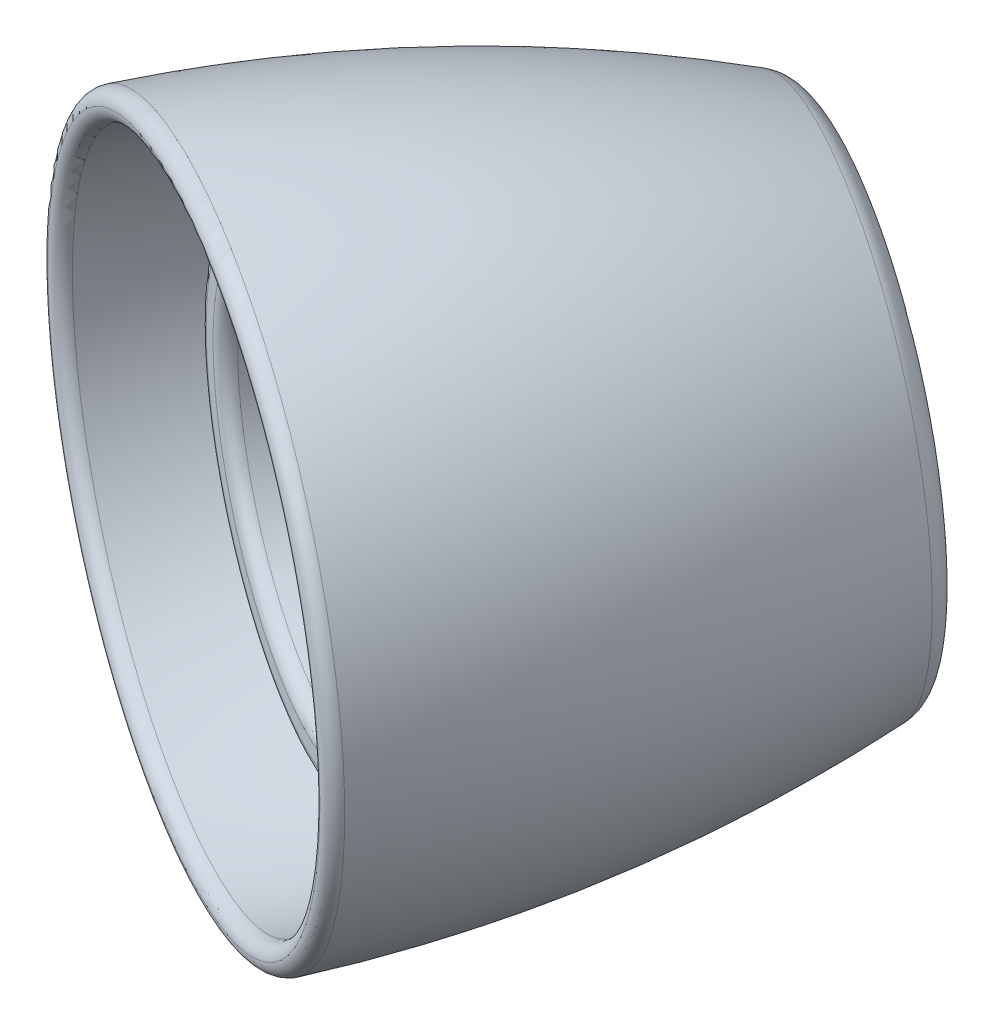
ISO-10303-21;
HEADER;
FILE_DESCRIPTION(('STEP AP214'),'2;1');
FILE_NAME('part.step','',(''),(''),'','','');
FILE_SCHEMA(('AUTOMOTIVE_DESIGN { 1 0 10303 214 1 1 1 1 }'));
ENDSEC;
DATA;
#1=APPLICATION_CONTEXT('core data for automotive mechanical design processes');
#2=APPLICATION_PROTOCOL_DEFINITION('international standard','automotive_design',2000,#1);
#3=PRODUCT_CONTEXT('',#1,'mechanical');
#4=PRODUCT('Part','Part','',(#3));
#5=PRODUCT_RELATED_PRODUCT_CATEGORY('part','',(#4));
#6=PRODUCT_DEFINITION_FORMATION('','',#4);
#7=PRODUCT_DEFINITION_CONTEXT('part definition',#1,'design');
#8=PRODUCT_DEFINITION('design','',#6,#7);
#9=PRODUCT_DEFINITION_SHAPE('','',#8);
#10=(LENGTH_UNIT() NAMED_UNIT(*) SI_UNIT(.MILLI.,.METRE.));
#11=(NAMED_UNIT(*) PLANE_ANGLE_UNIT() SI_UNIT($,.RADIAN.));
#12=(NAMED_UNIT(*) SI_UNIT($,.STERADIAN.) SOLID_ANGLE_UNIT());
#13=UNCERTAINTY_MEASURE_WITH_UNIT(LENGTH_MEASURE(1.E-05),#10,'distance_accuracy_value','');
#14=(GEOMETRIC_REPRESENTATION_CONTEXT(3) GLOBAL_UNCERTAINTY_ASSIGNED_CONTEXT((#13)) GLOBAL_UNIT_ASSIGNED_CONTEXT((#10,
#11,#12)) REPRESENTATION_CONTEXT('',''));
#15=CARTESIAN_POINT('',(0.,0.,0.));
#16=DIRECTION('',(0.,0.,1.));
#17=DIRECTION('',(1.,0.,0.));
#18=AXIS2_PLACEMENT_3D('',#15,#16,#17);
#19=CARTESIAN_POINT('',(-1.92824216806043,-8.23663197239245,23.7918539048536));
#20=DIRECTION('',(-0.453212083113773,-0.0300186712748521,0.890897124866035));
#21=DIRECTION('',(0.41626094218873,-0.890897124866035,0.181739211271491));
#22=AXIS2_PLACEMENT_3D('',#19,#20,#21);
#23=CYLINDRICAL_SURFACE('',#22,3.24582561371548);
#24=CARTESIAN_POINT('',(2.34781383611801,-7.95340580891422,15.3862395317425));
#25=DIRECTION('',(0.453212083113773,0.0300186712748521,-0.890897124866035));
#26=DIRECTION('',(0.41626094218873,-0.890897124866035,0.181739211271491));
#27=AXIS2_PLACEMENT_3D('',#24,#25,#26);
#28=CIRCLE('',#27,3.24582561371548);
#29=CARTESIAN_POINT('',(3.69892426426354,-10.8451025159899,15.976133318704));
#30=VERTEX_POINT('',#29);
#31=EDGE_CURVE('E93',#30,#30,#28,.F.);
#32=ORIENTED_EDGE('',*,*,#31,.F.);
#33=EDGE_LOOP('',(#32));
#34=FACE_BOUND('',#33,.T.);
#35=CARTESIAN_POINT('',(1.84928054469287,-7.98642634731656,16.3662263690952));
#36=DIRECTION('',(-0.453212083113773,-0.0300186712748521,0.890897124866035));
#37=DIRECTION('',(-0.41626094218873,0.890897124866035,-0.181739211271491));
#38=AXIS2_PLACEMENT_3D('',#35,#36,#37);
#39=CIRCLE('',#38,3.24582561371548);
#40=CARTESIAN_POINT('',(0.498170116547345,-5.09472964024091,15.7763325821337));
#41=VERTEX_POINT('',#40);
#42=EDGE_CURVE('E97',#41,#41,#39,.F.);
#43=ORIENTED_EDGE('',*,*,#42,.F.);
#44=EDGE_LOOP('',(#43));
#45=FACE_BOUND('',#44,.T.);
#46=ADVANCED_FACE('F15',(#34,#45),#23,.F.);
#47=CARTESIAN_POINT('',(0.609668121717728,-5.58336181099489,16.0972048205766));
#48=DIRECTION('',(0.453212083113773,0.0300186712748521,-0.890897124866035));
#49=DIRECTION('',(-0.41626094218873,0.890897124866035,-0.181739211271491));
#50=AXIS2_PLACEMENT_3D('',#47,#48,#49);
#51=PLANE('',#50);
#52=CARTESIAN_POINT('',(1.73597752391442,-7.99393101513527,16.5889506503116));
#53=DIRECTION('',(-0.453212083113773,-0.0300186712748521,0.890897124866035));
#54=DIRECTION('',(-0.41626094218873,0.890897124866035,-0.181739211271491));
#55=AXIS2_PLACEMENT_3D('',#52,#53,#54);
#56=CIRCLE('',#55,2.99582561371548);
#57=CARTESIAN_POINT('',(0.488932331316082,-5.32495858927612,16.0444916661681));
#58=VERTEX_POINT('',#57);
#59=EDGE_CURVE('E85',#58,#58,#56,.T.);
#60=ORIENTED_EDGE('',*,*,#59,.F.);
#61=EDGE_LOOP('',(#60));
#62=FACE_BOUND('',#61,.T.);
#63=CARTESIAN_POINT('',(1.73597752391442,-7.99393101513527,16.5889506503116));
#64=DIRECTION('',(-0.453212083113773,-0.0300186712748521,0.890897124866035));
#65=DIRECTION('',(-0.41626094218873,0.890897124866035,-0.181739211271491));
#66=AXIS2_PLACEMENT_3D('',#63,#64,#65);
#67=CIRCLE('',#66,2.95577728545579);
#68=CARTESIAN_POINT('',(0.505602886170547,-5.36063752977838,16.0517700177587));
#69=VERTEX_POINT('',#68);
#70=EDGE_CURVE('E89',#69,#69,#67,.F.);
#71=ORIENTED_EDGE('',*,*,#70,.F.);
#72=EDGE_LOOP('',(#71));
#73=FACE_BOUND('',#72,.T.);
#74=ADVANCED_FACE('F181',(#62,#73),#51,.T.);
#75=CARTESIAN_POINT('',(-1.92824216806043,-8.23663197239245,23.7918539048536));
#76=DIRECTION('',(-0.453212083113773,-0.0300186712748521,0.890897124866035));
#77=DIRECTION('',(0.41626094218873,-0.890897124866035,0.181739211271491));
#78=AXIS2_PLACEMENT_3D('',#75,#76,#77);
#79=CYLINDRICAL_SURFACE('',#78,2.70577728545579);
#80=CARTESIAN_POINT('',(1.62267450313598,-8.00143568295398,16.8116749315281));
#81=DIRECTION('',(-0.453212083113773,-0.0300186712748521,0.890897124866035));
#82=DIRECTION('',(-0.41626094218873,0.890897124866035,-0.181739211271491));
#83=AXIS2_PLACEMENT_3D('',#80,#81,#82);
#84=CIRCLE('',#83,2.70577728545579);
#85=CARTESIAN_POINT('',(0.496365100939284,-5.5908664788136,16.3199291017931));
#86=VERTEX_POINT('',#85);
#87=EDGE_CURVE('E78',#86,#86,#84,.T.);
#88=ORIENTED_EDGE('',*,*,#87,.F.);
#89=EDGE_LOOP('',(#88));
#90=FACE_BOUND('',#89,.T.);
#91=CARTESIAN_POINT('',(1.21478362833358,-8.02845248710135,17.6134823439076));
#92=DIRECTION('',(0.453212083113773,0.0300186712748521,-0.890897124866035));
#93=DIRECTION('',(0.41626094218873,-0.890897124866035,0.181739211271491));
#94=AXIS2_PLACEMENT_3D('',#91,#92,#93);
#95=CIRCLE('',#94,2.70577728545579);
#96=CARTESIAN_POINT('',(2.34109303053027,-10.4390216912417,18.1052281736427));
#97=VERTEX_POINT('',#96);
#98=EDGE_CURVE('E81',#97,#97,#95,.T.);
#99=ORIENTED_EDGE('',*,*,#98,.F.);
#100=EDGE_LOOP('',(#99));
#101=FACE_BOUND('',#100,.T.);
#102=ADVANCED_FACE('F177',(#90,#101),#79,.F.);
#103=CARTESIAN_POINT('',(-0.0248287946415541,-5.62538795077968,17.3444607953891));
#104=DIRECTION('',(-0.453212083113773,-0.0300186712748521,0.890897124866035));
#105=DIRECTION('',(0.41626094218873,-0.890897124866035,0.181739211271491));
#106=AXIS2_PLACEMENT_3D('',#103,#104,#105);
#107=PLANE('',#106);
#108=CARTESIAN_POINT('',(1.10148060755513,-8.03595715492006,17.8362066251241));
#109=DIRECTION('',(0.453212083113773,0.0300186712748521,-0.890897124866035));
#110=DIRECTION('',(0.41626094218873,-0.890897124866035,0.181739211271491));
#111=AXIS2_PLACEMENT_3D('',#108,#109,#110);
#112=CIRCLE('',#111,2.95577728545579);
#113=CARTESIAN_POINT('',(2.33185524529901,-10.669250640277,18.373387257677));
#114=VERTEX_POINT('',#113);
#115=EDGE_CURVE('E70',#114,#114,#112,.F.);
#116=ORIENTED_EDGE('',*,*,#115,.F.);
#117=EDGE_LOOP('',(#116));
#118=FACE_BOUND('',#117,.T.);
#119=CARTESIAN_POINT('',(1.10148060755513,-8.03595715492006,17.8362066251241));
#120=DIRECTION('',(0.453212083113773,0.0300186712748521,-0.890897124866035));
#121=DIRECTION('',(0.41626094218873,-0.890897124866035,0.181739211271491));
#122=AXIS2_PLACEMENT_3D('',#119,#120,#121);
#123=CIRCLE('',#122,2.99582561371548);
#124=CARTESIAN_POINT('',(2.34852580015347,-10.7049295807792,18.3806656092677));
#125=VERTEX_POINT('',#124);
#126=EDGE_CURVE('E74',#125,#125,#123,.T.);
#127=ORIENTED_EDGE('',*,*,#126,.F.);
#128=EDGE_LOOP('',(#127));
#129=FACE_BOUND('',#128,.T.);
#130=ADVANCED_FACE('F173',(#118,#129),#107,.T.);
#131=CARTESIAN_POINT('',(-1.92824216806043,-8.23663197239245,23.7918539048536));
#132=DIRECTION('',(-0.453212083113773,-0.0300186712748521,0.890897124866035));
#133=DIRECTION('',(0.41626094218873,-0.890897124866035,0.181739211271491));
#134=AXIS2_PLACEMENT_3D('',#131,#132,#133);
#135=CYLINDRICAL_SURFACE('',#134,3.24582561371548);
#136=CARTESIAN_POINT('',(0.988177586776692,-8.04346182273878,18.0589309063406));
#137=DIRECTION('',(0.453212083113773,0.0300186712748521,-0.890897124866035));
#138=DIRECTION('',(0.41626094218873,-0.890897124866035,0.181739211271491));
#139=AXIS2_PLACEMENT_3D('',#136,#137,#138);
#140=CIRCLE('',#139,3.24582561371548);
#141=CARTESIAN_POINT('',(2.33928801492221,-10.9351585298144,18.6488246933021));
#142=VERTEX_POINT('',#141);
#143=EDGE_CURVE('E62',#142,#142,#140,.F.);
#144=ORIENTED_EDGE('',*,*,#143,.F.);
#145=EDGE_LOOP('',(#144));
#146=FACE_BOUND('',#145,.T.);
#147=CARTESIAN_POINT('',(0.528727867670788,-8.07389364615885,18.9620896018452));
#148=DIRECTION('',(0.453212083113773,0.0300186712748521,-0.890897124866035));
#149=DIRECTION('',(0.41626094218873,-0.890897124866035,0.181739211271491));
#150=AXIS2_PLACEMENT_3D('',#147,#148,#149);
#151=CIRCLE('',#150,3.24582561371548);
#152=CARTESIAN_POINT('',(1.87983829581631,-10.9655903532345,19.5519833888067));
#153=VERTEX_POINT('',#152);
#154=EDGE_CURVE('E66',#153,#153,#151,.T.);
#155=ORIENTED_EDGE('',*,*,#154,.F.);
#156=EDGE_LOOP('',(#155));
#157=FACE_BOUND('',#156,.T.);
#158=ADVANCED_FACE('F169',(#146,#157),#135,.F.);
#159=CARTESIAN_POINT('',(-0.935685581253175,-5.18970160690191,18.5949200961003));
#160=DIRECTION('',(-0.453212083113773,-0.0300186712748521,0.890897124866035));
#161=DIRECTION('',(0.41626094218873,-0.890897124866035,0.181739211271491));
#162=AXIS2_PLACEMENT_3D('',#159,#160,#161);
#163=PLANE('',#162);
#164=CARTESIAN_POINT('',(0.415424846892344,-8.08139831397756,19.1848138830617));
#165=DIRECTION('',(0.453212083113773,0.0300186712748521,-0.890897124866035));
#166=DIRECTION('',(0.41626094218873,-0.890897124866035,0.181739211271491));
#167=AXIS2_PLACEMENT_3D('',#164,#165,#166);
#168=CIRCLE('',#167,3.49582561371548);
#169=CARTESIAN_POINT('',(1.87060051058505,-11.1958193022697,19.8201424728411));
#170=VERTEX_POINT('',#169);
#171=EDGE_CURVE('E38',#170,#170,#168,.F.);
#172=ORIENTED_EDGE('',*,*,#171,.F.);
#173=EDGE_LOOP('',(#172));
#174=FACE_BOUND('',#173,.T.);
#175=CARTESIAN_POINT('',(0.415424846892344,-8.08139831397756,19.1848138830617));
#176=DIRECTION('',(0.453212083113773,0.0300186712748521,-0.890897124866035));
#177=DIRECTION('',(0.41626094218873,-0.890897124866035,0.181739211271491));
#178=AXIS2_PLACEMENT_3D('',#175,#176,#177);
#179=CIRCLE('',#178,3.77857088456341);
#180=CARTESIAN_POINT('',(1.98829632342761,-11.4477162511376,19.8715283753557));
#181=VERTEX_POINT('',#180);
#182=EDGE_CURVE('E44',#181,#181,#179,.T.);
#183=ORIENTED_EDGE('',*,*,#182,.F.);
#184=EDGE_LOOP('',(#183));
#185=FACE_BOUND('',#184,.T.);
#186=ADVANCED_FACE('F165',(#174,#185),#163,.T.);
#187=CARTESIAN_POINT('',(-1.92824216806043,-8.23663197239245,23.7918539048536));
#188=DIRECTION('',(-0.453212083113773,-0.0300186712748521,0.890897124866035));
#189=DIRECTION('',(0.41626094218873,-0.890897124866035,0.181739211271491));
#190=AXIS2_PLACEMENT_3D('',#187,#188,#189);
#191=CYLINDRICAL_SURFACE('',#190,4.02857088456341);
#192=CARTESIAN_POINT('',(1.47541420474449,-8.01118952371409,17.1011503919848));
#193=DIRECTION('',(0.453212083113773,0.0300186712748521,-0.890897124866035));
#194=DIRECTION('',(0.41626094218873,-0.890897124866035,0.181739211271491));
#195=AXIS2_PLACEMENT_3D('',#192,#193,#194);
#196=CIRCLE('',#195,4.02857088456341);
#197=CARTESIAN_POINT('',(3.15235091682695,-11.6002317420906,17.8332996870967));
#198=VERTEX_POINT('',#197);
#199=EDGE_CURVE('E55',#198,#198,#196,.T.);
#200=ORIENTED_EDGE('',*,*,#199,.F.);
#201=EDGE_LOOP('',(#200));
#202=FACE_BOUND('',#201,.T.);
#203=CARTESIAN_POINT('',(0.528727867670788,-8.07389364615885,18.9620896018452));
#204=DIRECTION('',(0.453212083113773,0.0300186712748521,-0.890897124866035));
#205=DIRECTION('',(0.41626094218873,-0.890897124866035,0.181739211271491));
#206=AXIS2_PLACEMENT_3D('',#203,#204,#205);
#207=CIRCLE('',#206,4.02857088456341);
#208=CARTESIAN_POINT('',(2.20566457975324,-11.6629358645354,19.694238896957));
#209=VERTEX_POINT('',#208);
#210=EDGE_CURVE('E58',#209,#209,#207,.F.);
#211=ORIENTED_EDGE('',*,*,#210,.F.);
#212=EDGE_LOOP('',(#211));
#213=FACE_BOUND('',#212,.T.);
#214=ADVANCED_FACE('F161',(#202,#213),#191,.T.);
#215=CARTESIAN_POINT('',(-0.0882194865595111,-4.41464263751883,16.1462768156565));
#216=DIRECTION('',(-0.453212083113773,-0.0300186712748521,0.890897124866035));
#217=DIRECTION('',(0.41626094218873,-0.890897124866035,0.181739211271491));
#218=AXIS2_PLACEMENT_3D('',#215,#216,#217);
#219=PLANE('',#218);
#220=CARTESIAN_POINT('',(1.58871722552294,-8.00368485589538,16.8784261107683));
#221=DIRECTION('',(0.453212083113773,0.0300186712748521,-0.890897124866035));
#222=DIRECTION('',(0.41626094218873,-0.890897124866035,0.181739211271491));
#223=AXIS2_PLACEMENT_3D('',#220,#221,#222);
#224=CIRCLE('',#223,4.2785708845634);
#225=CARTESIAN_POINT('',(3.36971917315257,-11.8154513554884,17.656010208698));
#226=VERTEX_POINT('',#225);
#227=EDGE_CURVE('E48',#226,#226,#224,.F.);
#228=ORIENTED_EDGE('',*,*,#227,.F.);
#229=EDGE_LOOP('',(#228));
#230=FACE_BOUND('',#229,.T.);
#231=CARTESIAN_POINT('',(1.58871722552294,-8.00368485589538,16.8784261107683));
#232=DIRECTION('',(0.453212083113773,0.0300186712748521,-0.890897124866035));
#233=DIRECTION('',(0.41626094218873,-0.890897124866035,0.181739211271491));
#234=AXIS2_PLACEMENT_3D('',#231,#232,#233);
#235=CIRCLE('',#234,4.79273774166151);
#236=CARTESIAN_POINT('',(3.58374675353045,-12.2735211301786,17.749454487769));
#237=VERTEX_POINT('',#236);
#238=EDGE_CURVE('E52',#237,#237,#235,.T.);
#239=ORIENTED_EDGE('',*,*,#238,.F.);
#240=EDGE_LOOP('',(#239));
#241=FACE_BOUND('',#240,.T.);
#242=ADVANCED_FACE('F157',(#230,#241),#219,.T.);
#243=CARTESIAN_POINT('',(2.17155907076244,-4.55561842241409,12.0205937841694));
#244=CARTESIAN_POINT('',(1.73924212667713,-4.33531117061553,12.5993762028067));
#245=CARTESIAN_POINT('',(0.886072689311537,-3.95010381774629,13.7955572675327));
#246=CARTESIAN_POINT('',(-0.315878130017248,-3.5609253915247,15.647875886709));
#247=CARTESIAN_POINT('',(-1.45022401878436,-3.35375627529409,17.5703422472452));
#248=CARTESIAN_POINT('',(-2.16576616894374,-3.33850083961202,18.9087010873886));
#249=CARTESIAN_POINT('',(-2.50783947202255,-3.36115630113467,19.5811262065507));
#250=B_SPLINE_CURVE_WITH_KNOTS('',3,(#243,#244,#245,#246,#247,#248,#249),.UNSPECIFIED.,.F.,.F.,
(4,1,1,1,4),(0.,0.25,0.5,0.75,1.),.UNSPECIFIED.);
#251=CARTESIAN_POINT('',(-1.92824216806043,-8.23663197239245,23.7918539048536));
#252=DIRECTION('',(-0.453212083113773,-0.0300186712748521,0.890897124866035));
#253=AXIS1_PLACEMENT('',#251,#252);
#254=SURFACE_OF_REVOLUTION('',#250,#253);
#255=CARTESIAN_POINT('',(1.49343277529732,-8.00999605697651,17.0657305669232));
#256=DIRECTION('',(0.453212083113773,0.0300186712748521,-0.890897124866035));
#257=DIRECTION('',(0.41626094218873,-0.890897124866035,0.181739211271491));
#258=AXIS2_PLACEMENT_3D('',#255,#256,#257);
#259=CIRCLE('',#258,5.03955618251426);
#260=CARTESIAN_POINT('',(3.59120318004374,-12.4997221705793,17.9816155326917));
#261=VERTEX_POINT('',#260);
#262=EDGE_CURVE('E31',#261,#261,#259,.F.);
#263=ORIENTED_EDGE('',*,*,#262,.F.);
#264=EDGE_LOOP('',(#263));
#265=FACE_BOUND('',#264,.T.);
#266=CARTESIAN_POINT('',(-0.168631587893767,-8.120083509662,20.3329169851139));
#267=DIRECTION('',(0.453212083113773,0.0300186712748521,-0.890897124866035));
#268=DIRECTION('',(0.41626094218873,-0.890897124866035,0.181739211271491));
#269=AXIS2_PLACEMENT_3D('',#266,#267,#268);
#270=CIRCLE('',#269,5.34884288988972);
#271=CARTESIAN_POINT('',(2.05788279307122,-12.8853522616249,21.3050114731376));
#272=VERTEX_POINT('',#271);
#273=EDGE_CURVE('E101',#272,#272,#270,.T.);
#274=ORIENTED_EDGE('',*,*,#273,.F.);
#275=EDGE_LOOP('',(#274));
#276=FACE_BOUND('',#275,.T.);
#277=ADVANCED_FACE('F153',(#265,#276),#254,.F.);
#278=CARTESIAN_POINT('',(-2.50783947202256,-3.36115630113466,19.5811262065507));
#279=DIRECTION('',(-0.453212083113773,-0.0300186712748521,0.890897124866035));
#280=DIRECTION('',(0.41626094218873,-0.890897124866035,0.181739211271491));
#281=AXIS2_PLACEMENT_3D('',#278,#279,#280);
#282=PLANE('',#281);
#283=CARTESIAN_POINT('',(-0.28081624594187,-8.12751410230836,20.5534428559655));
#284=DIRECTION('',(0.453212083113773,0.0300186712748521,-0.890897124866035));
#285=DIRECTION('',(0.41626094218873,-0.890897124866035,0.181739211271491));
#286=AXIS2_PLACEMENT_3D('',#283,#284,#285);
#287=CIRCLE('',#286,5.59884535934687);
#288=CARTESIAN_POINT('',(2.04976439850886,-13.11550933552,21.5709725956042));
#289=VERTEX_POINT('',#288);
#290=EDGE_CURVE('E108',#289,#289,#287,.T.);
#291=ORIENTED_EDGE('',*,*,#290,.F.);
#292=EDGE_LOOP('',(#291));
#293=FACE_BOUND('',#292,.T.);
#294=CARTESIAN_POINT('',(-0.28081624594187,-8.12751410230836,20.5534428559655));
#295=DIRECTION('',(0.453212083113773,0.0300186712748521,-0.890897124866035));
#296=DIRECTION('',(0.41626094218873,-0.890897124866035,0.181739211271491));
#297=AXIS2_PLACEMENT_3D('',#294,#295,#296);
#298=CIRCLE('',#297,5.59883071113216);
#299=CARTESIAN_POINT('',(2.0497583010292,-13.1154962854677,21.5709699334493));
#300=VERTEX_POINT('',#299);
#301=EDGE_CURVE('E112',#300,#300,#298,.F.);
#302=ORIENTED_EDGE('',*,*,#301,.F.);
#303=EDGE_LOOP('',(#302));
#304=FACE_BOUND('',#303,.T.);
#305=ADVANCED_FACE('F148',(#293,#304),#282,.T.);
#306=CARTESIAN_POINT('',(-2.71596994311693,-2.91570773870165,19.4902566009149));
#307=CARTESIAN_POINT('',(-0.607069006577418,-2.7760238990073,15.3447056524892));
#308=CARTESIAN_POINT('',(2.05860671361164,-4.13443398663146,11.7759105578051));
#309=B_SPLINE_CURVE_WITH_KNOTS('',2,(#306,#307,#308),.UNSPECIFIED.,.F.,.F.,(3,3),(0.,1.),.UNSPECIFIED.);
#310=CARTESIAN_POINT('',(-1.92824216806043,-8.23663197239245,23.7918539048536));
#311=DIRECTION('',(-0.453212083113773,-0.0300186712748521,0.890897124866035));
#312=AXIS1_PLACEMENT('',#310,#311);
#313=SURFACE_OF_REVOLUTION('',#309,#312);
#314=CARTESIAN_POINT('',(-0.166406486762289,-8.11993612925907,20.3285430147931));
#315=DIRECTION('',(0.453212083113773,0.0300186712748521,-0.890897124866035));
#316=DIRECTION('',(0.41626094218873,-0.890897124866035,0.181739211271491));
#317=AXIS2_PLACEMENT_3D('',#314,#315,#316);
#318=CIRCLE('',#317,5.84883343245303);
#319=CARTESIAN_POINT('',(2.26823442853556,-13.3306450180518,21.3915053896654));
#320=VERTEX_POINT('',#319);
#321=EDGE_CURVE('E105',#320,#320,#318,.F.);
#322=ORIENTED_EDGE('',*,*,#321,.F.);
#323=EDGE_LOOP('',(#322));
#324=FACE_BOUND('',#323,.T.);
#325=CARTESIAN_POINT('',(3.64994534361208,-7.86715864310271,12.8265875289676));
#326=DIRECTION('',(0.453212083113773,0.0300186712748521,-0.890897124866035));
#327=DIRECTION('',(0.41626094218873,-0.890897124866035,0.181739211271491));
#328=AXIS2_PLACEMENT_3D('',#325,#326,#327);
#329=CIRCLE('',#328,4.30199098337212);
#330=CARTESIAN_POINT('',(5.44069616363798,-11.6997900413885,13.6084279771828));
#331=VERTEX_POINT('',#330);
#332=EDGE_CURVE('E128',#331,#331,#329,.T.);
#333=ORIENTED_EDGE('',*,*,#332,.F.);
#334=EDGE_LOOP('',(#333));
#335=FACE_BOUND('',#334,.T.);
#336=ADVANCED_FACE('F143',(#324,#335),#313,.F.);
#337=CARTESIAN_POINT('',(2.65337491106307,-5.4073789674531,12.0355859011746));
#338=DIRECTION('',(0.453212083113773,0.0300186712748521,-0.890897124866035));
#339=DIRECTION('',(-0.41626094218873,0.890897124866035,-0.181739211271491));
#340=AXIS2_PLACEMENT_3D('',#337,#338,#339);
#341=PLANE('',#340);
#342=CARTESIAN_POINT('',(3.79809250208208,-7.85734606083469,12.5353687321712));
#343=DIRECTION('',(-0.453212083113773,-0.0300186712748521,0.890897124866035));
#344=DIRECTION('',(-0.41626094218873,0.890897124866035,-0.181739211271491));
#345=AXIS2_PLACEMENT_3D('',#342,#343,#344);
#346=CIRCLE('',#345,3.83291702671831);
#347=CARTESIAN_POINT('',(2.20259884920909,-4.44261130188127,11.8387774148663));
#348=VERTEX_POINT('',#347);
#349=EDGE_CURVE('E120',#348,#348,#346,.T.);
#350=ORIENTED_EDGE('',*,*,#349,.F.);
#351=EDGE_LOOP('',(#350));
#352=FACE_BOUND('',#351,.T.);
#353=CARTESIAN_POINT('',(3.79809250208208,-7.85734606083469,12.5353687321712));
#354=DIRECTION('',(-0.453212083113773,-0.0300186712748521,0.890897124866035));
#355=DIRECTION('',(-0.41626094218873,0.890897124866035,-0.181739211271491));
#356=AXIS2_PLACEMENT_3D('',#353,#354,#355);
#357=CIRCLE('',#356,3.25);
#358=CARTESIAN_POINT('',(2.44524443996871,-4.96193040502008,11.9447162955389));
#359=VERTEX_POINT('',#358);
#360=EDGE_CURVE('E124',#359,#359,#357,.F.);
#361=ORIENTED_EDGE('',*,*,#360,.F.);
#362=EDGE_LOOP('',(#361));
#363=FACE_BOUND('',#362,.T.);
#364=ADVANCED_FACE('F147',(#352,#363),#341,.T.);
#365=CARTESIAN_POINT('',(-1.92824216806043,-8.23663197239245,23.7918539048536));
#366=DIRECTION('',(-0.453212083113773,-0.0300186712748521,0.890897124866035));
#367=DIRECTION('',(0.41626094218873,-0.890897124866035,0.181739211271491));
#368=AXIS2_PLACEMENT_3D('',#365,#366,#367);
#369=CYLINDRICAL_SURFACE('',#368,2.75);
#370=CARTESIAN_POINT('',(2.57441198008974,-7.93839699637629,14.9408064939086));
#371=DIRECTION('',(-0.453212083113773,-0.0300186712748521,0.890897124866035));
#372=DIRECTION('',(-0.41626094218873,0.890897124866035,-0.181739211271491));
#373=AXIS2_PLACEMENT_3D('',#370,#371,#372);
#374=CIRCLE('',#373,2.75);
#375=CARTESIAN_POINT('',(1.42969438907073,-5.48842990299469,14.441023662912));
#376=VERTEX_POINT('',#375);
#377=EDGE_CURVE('E23',#376,#376,#374,.F.);
#378=ORIENTED_EDGE('',*,*,#377,.F.);
#379=EDGE_LOOP('',(#378));
#380=FACE_BOUND('',#379,.T.);
#381=CARTESIAN_POINT('',(3.5714864605252,-7.87235539647212,12.9808172946042));
#382=DIRECTION('',(-0.453212083113773,-0.0300186712748521,0.890897124866035));
#383=DIRECTION('',(-0.41626094218873,0.890897124866035,-0.181739211271491));
#384=AXIS2_PLACEMENT_3D('',#381,#382,#383);
#385=CIRCLE('',#384,2.75);
#386=CARTESIAN_POINT('',(2.42676886950619,-5.42238830309052,12.4810344636076));
#387=VERTEX_POINT('',#386);
#388=EDGE_CURVE('E116',#387,#387,#385,.T.);
#389=ORIENTED_EDGE('',*,*,#388,.F.);
#390=EDGE_LOOP('',(#389));
#391=FACE_BOUND('',#390,.T.);
#392=ADVANCED_FACE('F193',(#380,#391),#369,.F.);
#393=CARTESIAN_POINT('',(3.5714864605252,-7.87235539647212,12.9808172946042));
#394=DIRECTION('',(-0.453212083113773,-0.0300186712748521,0.890897124866035));
#395=DIRECTION('',(0.41626094218873,-0.890897124866035,0.181739211271491));
#396=AXIS2_PLACEMENT_3D('',#393,#394,#395);
#397=TOROIDAL_SURFACE('',#396,3.83291702671831,0.5);
#398=ORIENTED_EDGE('',*,*,#349,.T.);
#399=EDGE_LOOP('',(#398));
#400=FACE_BOUND('',#399,.T.);
#401=ORIENTED_EDGE('',*,*,#332,.T.);
#402=EDGE_LOOP('',(#401));
#403=FACE_BOUND('',#402,.T.);
#404=ADVANCED_FACE('F189',(#400,#403),#397,.T.);
#405=CARTESIAN_POINT('',(3.5714864605252,-7.87235539647212,12.9808172946042));
#406=DIRECTION('',(0.453212083113773,0.0300186712748521,-0.890897124866035));
#407=DIRECTION('',(-0.41626094218873,0.890897124866035,-0.181739211271491));
#408=AXIS2_PLACEMENT_3D('',#405,#406,#407);
#409=TOROIDAL_SURFACE('',#408,3.25,0.5);
#410=ORIENTED_EDGE('',*,*,#388,.T.);
#411=EDGE_LOOP('',(#410));
#412=FACE_BOUND('',#411,.T.);
#413=ORIENTED_EDGE('',*,*,#360,.T.);
#414=EDGE_LOOP('',(#413));
#415=FACE_BOUND('',#414,.T.);
#416=ADVANCED_FACE('F192',(#412,#415),#409,.T.);
#417=CARTESIAN_POINT('',(-0.167513225163445,-8.12000943448965,20.330718574749));
#418=DIRECTION('',(-0.453212083113773,-0.0300186712748521,0.890897124866035));
#419=DIRECTION('',(0.41626094218873,-0.890897124866035,0.181739211271491));
#420=AXIS2_PLACEMENT_3D('',#417,#418,#419);
#421=TOROIDAL_SURFACE('',#420,5.59884535934687,0.25);
#422=ORIENTED_EDGE('',*,*,#321,.T.);
#423=EDGE_LOOP('',(#422));
#424=FACE_BOUND('',#423,.T.);
#425=ORIENTED_EDGE('',*,*,#290,.T.);
#426=EDGE_LOOP('',(#425));
#427=FACE_BOUND('',#426,.T.);
#428=ADVANCED_FACE('F197',(#424,#427),#421,.T.);
#429=CARTESIAN_POINT('',(-0.167513225163427,-8.12000943448965,20.330718574749));
#430=DIRECTION('',(-0.453212083113773,-0.0300186712748521,0.890897124866035));
#431=DIRECTION('',(0.41626094218873,-0.890897124866035,0.181739211271491));
#432=AXIS2_PLACEMENT_3D('',#429,#430,#431);
#433=TOROIDAL_SURFACE('',#432,5.59883071113216,0.25);
#434=ORIENTED_EDGE('',*,*,#301,.T.);
#435=EDGE_LOOP('',(#434));
#436=FACE_BOUND('',#435,.T.);
#437=ORIENTED_EDGE('',*,*,#273,.T.);
#438=EDGE_LOOP('',(#437));
#439=FACE_BOUND('',#438,.T.);
#440=ADVANCED_FACE('F201',(#436,#439),#433,.T.);
#441=CARTESIAN_POINT('',(2.34781383611801,-7.95340580891422,15.3862395317425));
#442=DIRECTION('',(-0.453212083113773,-0.0300186712748521,0.890897124866035));
#443=DIRECTION('',(0.41626094218873,-0.890897124866035,0.181739211271491));
#444=AXIS2_PLACEMENT_3D('',#441,#442,#443);
#445=TOROIDAL_SURFACE('',#444,2.99582561371548,0.25);
#446=CARTESIAN_POINT('',(2.46111290813377,-7.94590140264327,15.1635230127668));
#447=DIRECTION('',(0.453212083113773,0.0300186712748521,-0.890897124866035));
#448=DIRECTION('',(0.41626094218873,-0.890897124866035,0.181739211271491));
#449=AXIS2_PLACEMENT_3D('',#446,#447,#448);
#450=CIRCLE('',#449,2.99791280685829);
#451=CARTESIAN_POINT('',(3.70902691771626,-10.6167333028724,15.7083613217459));
#452=VERTEX_POINT('',#451);
#453=EDGE_CURVE('E10',#452,#452,#450,.F.);
#454=ORIENTED_EDGE('',*,*,#453,.F.);
#455=EDGE_LOOP('',(#454));
#456=FACE_BOUND('',#455,.T.);
#457=ORIENTED_EDGE('',*,*,#31,.T.);
#458=EDGE_LOOP('',(#457));
#459=FACE_BOUND('',#458,.T.);
#460=ADVANCED_FACE('F205',(#456,#459),#445,.F.);
#461=CARTESIAN_POINT('',(1.84928054469287,-7.98642634731656,16.3662263690952));
#462=DIRECTION('',(0.453212083113773,0.0300186712748521,-0.890897124866035));
#463=DIRECTION('',(-0.41626094218873,0.890897124866035,-0.181739211271491));
#464=AXIS2_PLACEMENT_3D('',#461,#462,#463);
#465=TOROIDAL_SURFACE('',#464,2.99582561371548,0.25);
#466=ORIENTED_EDGE('',*,*,#59,.T.);
#467=EDGE_LOOP('',(#466));
#468=FACE_BOUND('',#467,.T.);
#469=ORIENTED_EDGE('',*,*,#42,.T.);
#470=EDGE_LOOP('',(#469));
#471=FACE_BOUND('',#470,.T.);
#472=ADVANCED_FACE('F209',(#468,#471),#465,.F.);
#473=CARTESIAN_POINT('',(1.62267450313598,-8.00143568295398,16.8116749315281));
#474=DIRECTION('',(0.453212083113773,0.0300186712748521,-0.890897124866035));
#475=DIRECTION('',(-0.41626094218873,0.890897124866035,-0.181739211271491));
#476=AXIS2_PLACEMENT_3D('',#473,#474,#475);
#477=TOROIDAL_SURFACE('',#476,2.95577728545579,0.25);
#478=ORIENTED_EDGE('',*,*,#87,.T.);
#479=EDGE_LOOP('',(#478));
#480=FACE_BOUND('',#479,.T.);
#481=ORIENTED_EDGE('',*,*,#70,.T.);
#482=EDGE_LOOP('',(#481));
#483=FACE_BOUND('',#482,.T.);
#484=ADVANCED_FACE('F213',(#480,#483),#477,.T.);
#485=CARTESIAN_POINT('',(1.21478362833358,-8.02845248710135,17.6134823439076));
#486=DIRECTION('',(-0.453212083113773,-0.0300186712748521,0.890897124866035));
#487=DIRECTION('',(0.41626094218873,-0.890897124866035,0.181739211271491));
#488=AXIS2_PLACEMENT_3D('',#485,#486,#487);
#489=TOROIDAL_SURFACE('',#488,2.95577728545579,0.25);
#490=ORIENTED_EDGE('',*,*,#115,.T.);
#491=EDGE_LOOP('',(#490));
#492=FACE_BOUND('',#491,.T.);
#493=ORIENTED_EDGE('',*,*,#98,.T.);
#494=EDGE_LOOP('',(#493));
#495=FACE_BOUND('',#494,.T.);
#496=ADVANCED_FACE('F217',(#492,#495),#489,.T.);
#497=CARTESIAN_POINT('',(0.988177586776692,-8.04346182273878,18.0589309063406));
#498=DIRECTION('',(-0.453212083113773,-0.0300186712748521,0.890897124866035));
#499=DIRECTION('',(0.41626094218873,-0.890897124866035,0.181739211271491));
#500=AXIS2_PLACEMENT_3D('',#497,#498,#499);
#501=TOROIDAL_SURFACE('',#500,2.99582561371548,0.25);
#502=ORIENTED_EDGE('',*,*,#143,.T.);
#503=EDGE_LOOP('',(#502));
#504=FACE_BOUND('',#503,.T.);
#505=ORIENTED_EDGE('',*,*,#126,.T.);
#506=EDGE_LOOP('',(#505));
#507=FACE_BOUND('',#506,.T.);
#508=ADVANCED_FACE('F221',(#504,#507),#501,.F.);
#509=CARTESIAN_POINT('',(1.47541420474449,-8.01118952371409,17.1011503919848));
#510=DIRECTION('',(-0.453212083113773,-0.0300186712748521,0.890897124866035));
#511=DIRECTION('',(0.41626094218873,-0.890897124866035,0.181739211271491));
#512=AXIS2_PLACEMENT_3D('',#509,#510,#511);
#513=TOROIDAL_SURFACE('',#512,4.2785708845634,0.25);
#514=ORIENTED_EDGE('',*,*,#227,.T.);
#515=EDGE_LOOP('',(#514));
#516=FACE_BOUND('',#515,.T.);
#517=ORIENTED_EDGE('',*,*,#199,.T.);
#518=EDGE_LOOP('',(#517));
#519=FACE_BOUND('',#518,.T.);
#520=ADVANCED_FACE('F225',(#516,#519),#513,.F.);
#521=CARTESIAN_POINT('',(0.528727867670788,-8.07389364615885,18.9620896018452));
#522=DIRECTION('',(-0.453212083113773,-0.0300186712748521,0.890897124866035));
#523=DIRECTION('',(0.41626094218873,-0.890897124866035,0.181739211271491));
#524=AXIS2_PLACEMENT_3D('',#521,#522,#523);
#525=TOROIDAL_SURFACE('',#524,3.49582561371548,0.25);
#526=ORIENTED_EDGE('',*,*,#171,.T.);
#527=EDGE_LOOP('',(#526));
#528=FACE_BOUND('',#527,.T.);
#529=ORIENTED_EDGE('',*,*,#154,.T.);
#530=EDGE_LOOP('',(#529));
#531=FACE_BOUND('',#530,.T.);
#532=ADVANCED_FACE('F229',(#528,#531),#525,.T.);
#533=CARTESIAN_POINT('',(0.528727867670788,-8.07389364615885,18.9620896018452));
#534=DIRECTION('',(-0.453212083113773,-0.0300186712748521,0.890897124866035));
#535=DIRECTION('',(0.41626094218873,-0.890897124866035,0.181739211271491));
#536=AXIS2_PLACEMENT_3D('',#533,#534,#535);
#537=TOROIDAL_SURFACE('',#536,3.77857088456341,0.25);
#538=ORIENTED_EDGE('',*,*,#210,.T.);
#539=EDGE_LOOP('',(#538));
#540=FACE_BOUND('',#539,.T.);
#541=ORIENTED_EDGE('',*,*,#182,.T.);
#542=EDGE_LOOP('',(#541));
#543=FACE_BOUND('',#542,.T.);
#544=ADVANCED_FACE('F233',(#540,#543),#537,.T.);
#545=CARTESIAN_POINT('',(1.47541420474447,-8.0111895237141,17.1011503919849));
#546=DIRECTION('',(-0.453212083113773,-0.0300186712748521,0.890897124866035));
#547=DIRECTION('',(0.41626094218873,-0.890897124866035,0.181739211271491));
#548=AXIS2_PLACEMENT_3D('',#545,#546,#547);
#549=TOROIDAL_SURFACE('',#548,4.79273774166151,0.25);
#550=ORIENTED_EDGE('',*,*,#262,.T.);
#551=EDGE_LOOP('',(#550));
#552=FACE_BOUND('',#551,.T.);
#553=ORIENTED_EDGE('',*,*,#238,.T.);
#554=EDGE_LOOP('',(#553));
#555=FACE_BOUND('',#554,.T.);
#556=ADVANCED_FACE('F236',(#552,#555),#549,.F.);
#557=CARTESIAN_POINT('',(2.57441198008974,-7.93839699637629,14.9408064939086));
#558=DIRECTION('',(0.453212083113773,0.0300186712748521,-0.890897124866035));
#559=DIRECTION('',(-0.41626094218873,0.890897124866035,-0.181739211271491));
#560=AXIS2_PLACEMENT_3D('',#557,#558,#559);
#561=TOROIDAL_SURFACE('',#560,3.,0.25);
#562=ORIENTED_EDGE('',*,*,#453,.T.);
#563=EDGE_LOOP('',(#562));
#564=FACE_BOUND('',#563,.T.);
#565=ORIENTED_EDGE('',*,*,#377,.T.);
#566=EDGE_LOOP('',(#565));
#567=FACE_BOUND('',#566,.T.);
#568=ADVANCED_FACE('F17',(#564,#567),#561,.T.);
#569=CLOSED_SHELL('',(#46,#74,#102,#130,#158,#186,#214,#242,#277,#305,#336,#364,#392,#404,#416,
#428,#440,#460,#472,#484,#496,#508,#520,#532,#544,#556,#568));
#570=MANIFOLD_SOLID_BREP('B1',#569);
#571=ADVANCED_BREP_SHAPE_REPRESENTATION('',(#18,#570),#14);
#572=SHAPE_DEFINITION_REPRESENTATION(#9,#571);
ENDSEC;
END-ISO-10303-21;
